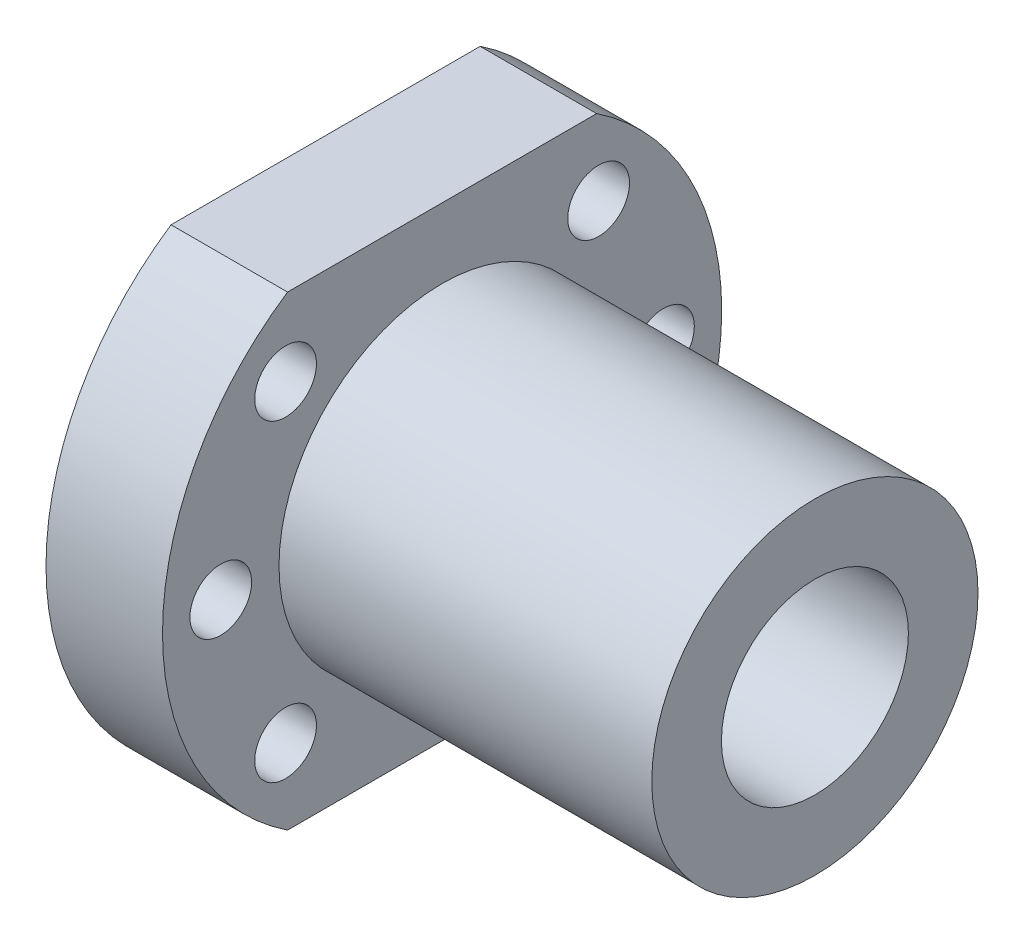
ISO-10303-21;
HEADER;
FILE_DESCRIPTION(('STEP AP214'),'2;1');
FILE_NAME('part.step','',(''),(''),'','','');
FILE_SCHEMA(('AUTOMOTIVE_DESIGN { 1 0 10303 214 1 1 1 1 }'));
ENDSEC;
DATA;
#1=APPLICATION_CONTEXT('core data for automotive mechanical design processes');
#2=APPLICATION_PROTOCOL_DEFINITION('international standard','automotive_design',2000,#1);
#3=PRODUCT_CONTEXT('',#1,'mechanical');
#4=PRODUCT('Part','Part','',(#3));
#5=PRODUCT_RELATED_PRODUCT_CATEGORY('part','',(#4));
#6=PRODUCT_DEFINITION_FORMATION('','',#4);
#7=PRODUCT_DEFINITION_CONTEXT('part definition',#1,'design');
#8=PRODUCT_DEFINITION('design','',#6,#7);
#9=PRODUCT_DEFINITION_SHAPE('','',#8);
#10=(LENGTH_UNIT() NAMED_UNIT(*) SI_UNIT(.MILLI.,.METRE.));
#11=(NAMED_UNIT(*) PLANE_ANGLE_UNIT() SI_UNIT($,.RADIAN.));
#12=(NAMED_UNIT(*) SI_UNIT($,.STERADIAN.) SOLID_ANGLE_UNIT());
#13=UNCERTAINTY_MEASURE_WITH_UNIT(LENGTH_MEASURE(1.E-05),#10,'distance_accuracy_value','');
#14=(GEOMETRIC_REPRESENTATION_CONTEXT(3) GLOBAL_UNCERTAINTY_ASSIGNED_CONTEXT((#13)) GLOBAL_UNIT_ASSIGNED_CONTEXT((#10,
#11,#12)) REPRESENTATION_CONTEXT('',''));
#15=CARTESIAN_POINT('',(0.,0.,0.));
#16=DIRECTION('',(0.,0.,1.));
#17=DIRECTION('',(1.,0.,0.));
#18=AXIS2_PLACEMENT_3D('',#15,#16,#17);
#19=CARTESIAN_POINT('',(10.,0.,0.));
#20=DIRECTION('',(-1.,0.,0.));
#21=DIRECTION('',(0.,0.,1.));
#22=AXIS2_PLACEMENT_3D('',#19,#20,#21);
#23=PLANE('',#22);
#24=CARTESIAN_POINT('',(10.,-13.4350288425444,-13.4350288425444));
#25=DIRECTION('',(1.,0.,0.));
#26=DIRECTION('',(0.,0.,-1.));
#27=AXIS2_PLACEMENT_3D('',#24,#25,#26);
#28=CIRCLE('',#27,2.65);
#29=CARTESIAN_POINT('',(10.,-13.4350288425444,-16.0850288425444));
#30=VERTEX_POINT('',#29);
#31=EDGE_CURVE('E186',#30,#30,#28,.T.);
#32=ORIENTED_EDGE('',*,*,#31,.F.);
#33=EDGE_LOOP('',(#32));
#34=FACE_BOUND('',#33,.T.);
#35=CARTESIAN_POINT('',(10.,13.4350288425444,13.4350288425444));
#36=DIRECTION('',(1.,0.,0.));
#37=DIRECTION('',(0.,0.,-1.));
#38=AXIS2_PLACEMENT_3D('',#35,#36,#37);
#39=CIRCLE('',#38,2.65);
#40=CARTESIAN_POINT('',(10.,13.4350288425444,10.7850288425444));
#41=VERTEX_POINT('',#40);
#42=EDGE_CURVE('E192',#41,#41,#39,.T.);
#43=ORIENTED_EDGE('',*,*,#42,.F.);
#44=EDGE_LOOP('',(#43));
#45=FACE_BOUND('',#44,.T.);
#46=CARTESIAN_POINT('',(10.,0.,19.));
#47=DIRECTION('',(1.,0.,0.));
#48=DIRECTION('',(0.,0.,-1.));
#49=AXIS2_PLACEMENT_3D('',#46,#47,#48);
#50=CIRCLE('',#49,2.65);
#51=CARTESIAN_POINT('',(10.,0.,16.35));
#52=VERTEX_POINT('',#51);
#53=EDGE_CURVE('E198',#52,#52,#50,.T.);
#54=ORIENTED_EDGE('',*,*,#53,.F.);
#55=EDGE_LOOP('',(#54));
#56=FACE_BOUND('',#55,.T.);
#57=CARTESIAN_POINT('',(10.,-13.4350288425444,13.4350288425444));
#58=DIRECTION('',(1.,0.,0.));
#59=DIRECTION('',(0.,0.,-1.));
#60=AXIS2_PLACEMENT_3D('',#57,#58,#59);
#61=CIRCLE('',#60,2.65);
#62=CARTESIAN_POINT('',(10.,-13.4350288425444,10.7850288425444));
#63=VERTEX_POINT('',#62);
#64=EDGE_CURVE('E204',#63,#63,#61,.T.);
#65=ORIENTED_EDGE('',*,*,#64,.F.);
#66=EDGE_LOOP('',(#65));
#67=FACE_BOUND('',#66,.T.);
#68=CARTESIAN_POINT('',(10.,0.,0.));
#69=DIRECTION('',(1.,0.,0.));
#70=DIRECTION('',(0.,0.,-1.));
#71=AXIS2_PLACEMENT_3D('',#68,#69,#70);
#72=CIRCLE('',#71,14.);
#73=CARTESIAN_POINT('',(10.,0.,-14.));
#74=VERTEX_POINT('',#73);
#75=EDGE_CURVE('E11',#74,#74,#72,.T.);
#76=ORIENTED_EDGE('',*,*,#75,.F.);
#77=EDGE_LOOP('',(#76));
#78=FACE_BOUND('',#77,.T.);
#79=CARTESIAN_POINT('',(10.,0.,0.));
#80=DIRECTION('',(-1.,0.,0.));
#81=DIRECTION('',(0.,0.,1.));
#82=AXIS2_PLACEMENT_3D('',#79,#80,#81);
#83=CIRCLE('',#82,24.);
#84=CARTESIAN_POINT('',(10.,20.,-13.2664991614216));
#85=VERTEX_POINT('',#84);
#86=CARTESIAN_POINT('',(10.,-20.,-13.2664991614216));
#87=VERTEX_POINT('',#86);
#88=EDGE_CURVE('E94',#85,#87,#83,.T.);
#89=ORIENTED_EDGE('',*,*,#88,.F.);
#90=DIRECTION('',(0.,0.,-1.));
#91=VECTOR('',#90,1.);
#92=CARTESIAN_POINT('',(10.,20.,13.2664991614216));
#93=LINE('',#92,#91);
#94=CARTESIAN_POINT('',(10.,20.,13.2664991614216));
#95=VERTEX_POINT('',#94);
#96=EDGE_CURVE('E91',#95,#85,#93,.T.);
#97=ORIENTED_EDGE('',*,*,#96,.F.);
#98=CARTESIAN_POINT('',(10.,0.,0.));
#99=DIRECTION('',(-1.,0.,0.));
#100=DIRECTION('',(0.,0.,1.));
#101=AXIS2_PLACEMENT_3D('',#98,#99,#100);
#102=CIRCLE('',#101,24.);
#103=CARTESIAN_POINT('',(10.,-20.,13.2664991614216));
#104=VERTEX_POINT('',#103);
#105=EDGE_CURVE('E84',#104,#95,#102,.T.);
#106=ORIENTED_EDGE('',*,*,#105,.F.);
#107=DIRECTION('',(0.,0.,1.));
#108=VECTOR('',#107,1.);
#109=CARTESIAN_POINT('',(10.,-20.,-13.2664991614216));
#110=LINE('',#109,#108);
#111=EDGE_CURVE('E90',#87,#104,#110,.T.);
#112=ORIENTED_EDGE('',*,*,#111,.F.);
#113=EDGE_LOOP('',(#89,#97,#106,#112));
#114=FACE_BOUND('',#113,.T.);
#115=CARTESIAN_POINT('',(10.,0.,-19.));
#116=DIRECTION('',(1.,0.,0.));
#117=DIRECTION('',(0.,0.,-1.));
#118=AXIS2_PLACEMENT_3D('',#115,#116,#117);
#119=CIRCLE('',#118,2.65);
#120=CARTESIAN_POINT('',(10.,0.,-21.65));
#121=VERTEX_POINT('',#120);
#122=EDGE_CURVE('E178',#121,#121,#119,.T.);
#123=ORIENTED_EDGE('',*,*,#122,.F.);
#124=EDGE_LOOP('',(#123));
#125=FACE_BOUND('',#124,.T.);
#126=CARTESIAN_POINT('',(10.,13.4350288425444,-13.4350288425444));
#127=DIRECTION('',(1.,0.,0.));
#128=DIRECTION('',(0.,0.,-1.));
#129=AXIS2_PLACEMENT_3D('',#126,#127,#128);
#130=CIRCLE('',#129,2.65);
#131=CARTESIAN_POINT('',(10.,13.4350288425444,-16.0850288425444));
#132=VERTEX_POINT('',#131);
#133=EDGE_CURVE('E175',#132,#132,#130,.T.);
#134=ORIENTED_EDGE('',*,*,#133,.F.);
#135=EDGE_LOOP('',(#134));
#136=FACE_BOUND('',#135,.T.);
#137=ADVANCED_FACE('F33',(#34,#45,#56,#67,#78,#114,#125,#136),#23,.F.);
#138=CARTESIAN_POINT('',(0.,0.,0.));
#139=DIRECTION('',(-1.,0.,0.));
#140=DIRECTION('',(0.,0.,1.));
#141=AXIS2_PLACEMENT_3D('',#138,#139,#140);
#142=PLANE('',#141);
#143=CARTESIAN_POINT('',(0.,13.4350288425444,-13.4350288425444));
#144=DIRECTION('',(1.,0.,0.));
#145=DIRECTION('',(0.,0.,-1.));
#146=AXIS2_PLACEMENT_3D('',#143,#144,#145);
#147=CIRCLE('',#146,2.65);
#148=CARTESIAN_POINT('',(0.,13.4350288425444,-16.0850288425444));
#149=VERTEX_POINT('',#148);
#150=EDGE_CURVE('E172',#149,#149,#147,.T.);
#151=ORIENTED_EDGE('',*,*,#150,.T.);
#152=EDGE_LOOP('',(#151));
#153=FACE_BOUND('',#152,.T.);
#154=CARTESIAN_POINT('',(0.,-13.4350288425444,-13.4350288425444));
#155=DIRECTION('',(1.,0.,0.));
#156=DIRECTION('',(0.,0.,-1.));
#157=AXIS2_PLACEMENT_3D('',#154,#155,#156);
#158=CIRCLE('',#157,2.65);
#159=CARTESIAN_POINT('',(0.,-13.4350288425444,-16.0850288425444));
#160=VERTEX_POINT('',#159);
#161=EDGE_CURVE('E189',#160,#160,#158,.T.);
#162=ORIENTED_EDGE('',*,*,#161,.T.);
#163=EDGE_LOOP('',(#162));
#164=FACE_BOUND('',#163,.T.);
#165=CARTESIAN_POINT('',(0.,13.4350288425444,13.4350288425444));
#166=DIRECTION('',(1.,0.,0.));
#167=DIRECTION('',(0.,0.,-1.));
#168=AXIS2_PLACEMENT_3D('',#165,#166,#167);
#169=CIRCLE('',#168,2.65);
#170=CARTESIAN_POINT('',(0.,13.4350288425444,10.7850288425444));
#171=VERTEX_POINT('',#170);
#172=EDGE_CURVE('E195',#171,#171,#169,.T.);
#173=ORIENTED_EDGE('',*,*,#172,.T.);
#174=EDGE_LOOP('',(#173));
#175=FACE_BOUND('',#174,.T.);
#176=CARTESIAN_POINT('',(0.,0.,19.));
#177=DIRECTION('',(1.,0.,0.));
#178=DIRECTION('',(0.,0.,-1.));
#179=AXIS2_PLACEMENT_3D('',#176,#177,#178);
#180=CIRCLE('',#179,2.65);
#181=CARTESIAN_POINT('',(0.,0.,16.35));
#182=VERTEX_POINT('',#181);
#183=EDGE_CURVE('E201',#182,#182,#180,.T.);
#184=ORIENTED_EDGE('',*,*,#183,.T.);
#185=EDGE_LOOP('',(#184));
#186=FACE_BOUND('',#185,.T.);
#187=CARTESIAN_POINT('',(0.,-13.4350288425444,13.4350288425444));
#188=DIRECTION('',(1.,0.,0.));
#189=DIRECTION('',(0.,0.,-1.));
#190=AXIS2_PLACEMENT_3D('',#187,#188,#189);
#191=CIRCLE('',#190,2.65);
#192=CARTESIAN_POINT('',(0.,-13.4350288425444,10.7850288425444));
#193=VERTEX_POINT('',#192);
#194=EDGE_CURVE('E207',#193,#193,#191,.T.);
#195=ORIENTED_EDGE('',*,*,#194,.T.);
#196=EDGE_LOOP('',(#195));
#197=FACE_BOUND('',#196,.T.);
#198=CARTESIAN_POINT('',(0.,0.,0.));
#199=DIRECTION('',(1.,0.,0.));
#200=DIRECTION('',(0.,0.,-1.));
#201=AXIS2_PLACEMENT_3D('',#198,#199,#200);
#202=CIRCLE('',#201,8.02500000000001);
#203=CARTESIAN_POINT('',(0.,0.,-8.02500000000001));
#204=VERTEX_POINT('',#203);
#205=EDGE_CURVE('E213',#204,#204,#202,.T.);
#206=ORIENTED_EDGE('',*,*,#205,.T.);
#207=EDGE_LOOP('',(#206));
#208=FACE_BOUND('',#207,.T.);
#209=CARTESIAN_POINT('',(0.,0.,0.));
#210=DIRECTION('',(-1.,0.,0.));
#211=DIRECTION('',(0.,0.,1.));
#212=AXIS2_PLACEMENT_3D('',#209,#210,#211);
#213=CIRCLE('',#212,24.);
#214=CARTESIAN_POINT('',(0.,20.,-13.2664991614216));
#215=VERTEX_POINT('',#214);
#216=CARTESIAN_POINT('',(0.,-20.,-13.2664991614216));
#217=VERTEX_POINT('',#216);
#218=EDGE_CURVE('E100',#215,#217,#213,.T.);
#219=ORIENTED_EDGE('',*,*,#218,.T.);
#220=DIRECTION('',(0.,0.,1.));
#221=VECTOR('',#220,1.);
#222=CARTESIAN_POINT('',(0.,-20.,-13.2664991614216));
#223=LINE('',#222,#221);
#224=CARTESIAN_POINT('',(0.,-20.,13.2664991614216));
#225=VERTEX_POINT('',#224);
#226=EDGE_CURVE('E103',#217,#225,#223,.T.);
#227=ORIENTED_EDGE('',*,*,#226,.T.);
#228=CARTESIAN_POINT('',(0.,0.,0.));
#229=DIRECTION('',(-1.,0.,0.));
#230=DIRECTION('',(0.,0.,1.));
#231=AXIS2_PLACEMENT_3D('',#228,#229,#230);
#232=CIRCLE('',#231,24.);
#233=CARTESIAN_POINT('',(0.,20.,13.2664991614216));
#234=VERTEX_POINT('',#233);
#235=EDGE_CURVE('E86',#225,#234,#232,.T.);
#236=ORIENTED_EDGE('',*,*,#235,.T.);
#237=DIRECTION('',(0.,0.,-1.));
#238=VECTOR('',#237,1.);
#239=CARTESIAN_POINT('',(0.,20.,13.2664991614216));
#240=LINE('',#239,#238);
#241=EDGE_CURVE('E96',#234,#215,#240,.T.);
#242=ORIENTED_EDGE('',*,*,#241,.T.);
#243=EDGE_LOOP('',(#219,#227,#236,#242));
#244=FACE_BOUND('',#243,.T.);
#245=CARTESIAN_POINT('',(0.,0.,-19.));
#246=DIRECTION('',(1.,0.,0.));
#247=DIRECTION('',(0.,0.,-1.));
#248=AXIS2_PLACEMENT_3D('',#245,#246,#247);
#249=CIRCLE('',#248,2.65);
#250=CARTESIAN_POINT('',(0.,0.,-21.65));
#251=VERTEX_POINT('',#250);
#252=EDGE_CURVE('E183',#251,#251,#249,.T.);
#253=ORIENTED_EDGE('',*,*,#252,.T.);
#254=EDGE_LOOP('',(#253));
#255=FACE_BOUND('',#254,.T.);
#256=ADVANCED_FACE('F111',(#153,#164,#175,#186,#197,#208,#244,#255),#142,.T.);
#257=CARTESIAN_POINT('',(10.,0.,0.));
#258=DIRECTION('',(-1.,0.,0.));
#259=DIRECTION('',(0.,0.,1.));
#260=AXIS2_PLACEMENT_3D('',#257,#258,#259);
#261=CYLINDRICAL_SURFACE('',#260,24.);
#262=ORIENTED_EDGE('',*,*,#218,.F.);
#263=DIRECTION('',(-1.,0.,0.));
#264=VECTOR('',#263,1.);
#265=CARTESIAN_POINT('',(10.,20.,-13.2664991614216));
#266=LINE('',#265,#264);
#267=EDGE_CURVE('E43',#85,#215,#266,.T.);
#268=ORIENTED_EDGE('',*,*,#267,.F.);
#269=ORIENTED_EDGE('',*,*,#88,.T.);
#270=DIRECTION('',(-1.,0.,0.));
#271=VECTOR('',#270,1.);
#272=CARTESIAN_POINT('',(10.,-20.,-13.2664991614216));
#273=LINE('',#272,#271);
#274=EDGE_CURVE('E37',#87,#217,#273,.T.);
#275=ORIENTED_EDGE('',*,*,#274,.T.);
#276=EDGE_LOOP('',(#262,#268,#269,#275));
#277=FACE_BOUND('',#276,.T.);
#278=ADVANCED_FACE('F35',(#277),#261,.T.);
#279=CARTESIAN_POINT('',(10.,20.,13.2664991614216));
#280=DIRECTION('',(0.,1.,0.));
#281=DIRECTION('',(0.,0.,1.));
#282=AXIS2_PLACEMENT_3D('',#279,#280,#281);
#283=PLANE('',#282);
#284=ORIENTED_EDGE('',*,*,#241,.F.);
#285=DIRECTION('',(-1.,0.,0.));
#286=VECTOR('',#285,1.);
#287=CARTESIAN_POINT('',(10.,20.,13.2664991614216));
#288=LINE('',#287,#286);
#289=EDGE_CURVE('E68',#95,#234,#288,.T.);
#290=ORIENTED_EDGE('',*,*,#289,.F.);
#291=ORIENTED_EDGE('',*,*,#96,.T.);
#292=ORIENTED_EDGE('',*,*,#267,.T.);
#293=EDGE_LOOP('',(#284,#290,#291,#292));
#294=FACE_BOUND('',#293,.T.);
#295=ADVANCED_FACE('F113',(#294),#283,.T.);
#296=CARTESIAN_POINT('',(10.,0.,0.));
#297=DIRECTION('',(-1.,0.,0.));
#298=DIRECTION('',(0.,0.,1.));
#299=AXIS2_PLACEMENT_3D('',#296,#297,#298);
#300=CYLINDRICAL_SURFACE('',#299,24.);
#301=ORIENTED_EDGE('',*,*,#235,.F.);
#302=DIRECTION('',(-1.,0.,0.));
#303=VECTOR('',#302,1.);
#304=CARTESIAN_POINT('',(10.,-20.,13.2664991614216));
#305=LINE('',#304,#303);
#306=EDGE_CURVE('E81',#104,#225,#305,.T.);
#307=ORIENTED_EDGE('',*,*,#306,.F.);
#308=ORIENTED_EDGE('',*,*,#105,.T.);
#309=ORIENTED_EDGE('',*,*,#289,.T.);
#310=EDGE_LOOP('',(#301,#307,#308,#309));
#311=FACE_BOUND('',#310,.T.);
#312=ADVANCED_FACE('F83',(#311),#300,.T.);
#313=CARTESIAN_POINT('',(10.,-20.,-13.2664991614216));
#314=DIRECTION('',(0.,-1.,0.));
#315=DIRECTION('',(0.,0.,-1.));
#316=AXIS2_PLACEMENT_3D('',#313,#314,#315);
#317=PLANE('',#316);
#318=ORIENTED_EDGE('',*,*,#226,.F.);
#319=ORIENTED_EDGE('',*,*,#274,.F.);
#320=ORIENTED_EDGE('',*,*,#111,.T.);
#321=ORIENTED_EDGE('',*,*,#306,.T.);
#322=EDGE_LOOP('',(#318,#319,#320,#321));
#323=FACE_BOUND('',#322,.T.);
#324=ADVANCED_FACE('F93',(#323),#317,.T.);
#325=CARTESIAN_POINT('',(10.,0.,0.));
#326=DIRECTION('',(1.,0.,0.));
#327=DIRECTION('',(0.,0.,-1.));
#328=AXIS2_PLACEMENT_3D('',#325,#326,#327);
#329=CYLINDRICAL_SURFACE('',#328,14.);
#330=ORIENTED_EDGE('',*,*,#75,.T.);
#331=EDGE_LOOP('',(#330));
#332=FACE_BOUND('',#331,.T.);
#333=CARTESIAN_POINT('',(42.,0.,0.));
#334=DIRECTION('',(1.,0.,0.));
#335=DIRECTION('',(0.,0.,-1.));
#336=AXIS2_PLACEMENT_3D('',#333,#334,#335);
#337=CIRCLE('',#336,14.);
#338=CARTESIAN_POINT('',(42.,0.,-14.));
#339=VERTEX_POINT('',#338);
#340=EDGE_CURVE('E104',#339,#339,#337,.T.);
#341=ORIENTED_EDGE('',*,*,#340,.F.);
#342=EDGE_LOOP('',(#341));
#343=FACE_BOUND('',#342,.T.);
#344=ADVANCED_FACE('F132',(#332,#343),#329,.T.);
#345=CARTESIAN_POINT('',(42.,0.,0.));
#346=DIRECTION('',(1.,0.,0.));
#347=DIRECTION('',(0.,0.,-1.));
#348=AXIS2_PLACEMENT_3D('',#345,#346,#347);
#349=PLANE('',#348);
#350=CARTESIAN_POINT('',(42.,0.,0.));
#351=DIRECTION('',(1.,0.,0.));
#352=DIRECTION('',(0.,0.,-1.));
#353=AXIS2_PLACEMENT_3D('',#350,#351,#352);
#354=CIRCLE('',#353,8.02500000000001);
#355=CARTESIAN_POINT('',(42.,0.,-8.02500000000001));
#356=VERTEX_POINT('',#355);
#357=EDGE_CURVE('E210',#356,#356,#354,.T.);
#358=ORIENTED_EDGE('',*,*,#357,.F.);
#359=EDGE_LOOP('',(#358));
#360=FACE_BOUND('',#359,.T.);
#361=ORIENTED_EDGE('',*,*,#340,.T.);
#362=EDGE_LOOP('',(#361));
#363=FACE_BOUND('',#362,.T.);
#364=ADVANCED_FACE('F135',(#360,#363),#349,.T.);
#365=CARTESIAN_POINT('',(42.,0.,0.));
#366=DIRECTION('',(1.,0.,0.));
#367=DIRECTION('',(0.,0.,-1.));
#368=AXIS2_PLACEMENT_3D('',#365,#366,#367);
#369=CYLINDRICAL_SURFACE('',#368,8.02500000000001);
#370=ORIENTED_EDGE('',*,*,#205,.F.);
#371=EDGE_LOOP('',(#370));
#372=FACE_BOUND('',#371,.T.);
#373=ORIENTED_EDGE('',*,*,#357,.T.);
#374=EDGE_LOOP('',(#373));
#375=FACE_BOUND('',#374,.T.);
#376=ADVANCED_FACE('F139',(#372,#375),#369,.F.);
#377=CARTESIAN_POINT('',(10.,-13.4350288425444,13.4350288425444));
#378=DIRECTION('',(1.,0.,0.));
#379=DIRECTION('',(0.,0.,-1.));
#380=AXIS2_PLACEMENT_3D('',#377,#378,#379);
#381=CYLINDRICAL_SURFACE('',#380,2.65);
#382=ORIENTED_EDGE('',*,*,#194,.F.);
#383=EDGE_LOOP('',(#382));
#384=FACE_BOUND('',#383,.T.);
#385=ORIENTED_EDGE('',*,*,#64,.T.);
#386=EDGE_LOOP('',(#385));
#387=FACE_BOUND('',#386,.T.);
#388=ADVANCED_FACE('F143',(#384,#387),#381,.F.);
#389=CARTESIAN_POINT('',(10.,0.,19.));
#390=DIRECTION('',(1.,0.,0.));
#391=DIRECTION('',(0.,0.,-1.));
#392=AXIS2_PLACEMENT_3D('',#389,#390,#391);
#393=CYLINDRICAL_SURFACE('',#392,2.65);
#394=ORIENTED_EDGE('',*,*,#183,.F.);
#395=EDGE_LOOP('',(#394));
#396=FACE_BOUND('',#395,.T.);
#397=ORIENTED_EDGE('',*,*,#53,.T.);
#398=EDGE_LOOP('',(#397));
#399=FACE_BOUND('',#398,.T.);
#400=ADVANCED_FACE('F147',(#396,#399),#393,.F.);
#401=CARTESIAN_POINT('',(10.,13.4350288425444,13.4350288425444));
#402=DIRECTION('',(1.,0.,0.));
#403=DIRECTION('',(0.,0.,-1.));
#404=AXIS2_PLACEMENT_3D('',#401,#402,#403);
#405=CYLINDRICAL_SURFACE('',#404,2.65);
#406=ORIENTED_EDGE('',*,*,#172,.F.);
#407=EDGE_LOOP('',(#406));
#408=FACE_BOUND('',#407,.T.);
#409=ORIENTED_EDGE('',*,*,#42,.T.);
#410=EDGE_LOOP('',(#409));
#411=FACE_BOUND('',#410,.T.);
#412=ADVANCED_FACE('F151',(#408,#411),#405,.F.);
#413=CARTESIAN_POINT('',(10.,-13.4350288425444,-13.4350288425444));
#414=DIRECTION('',(1.,0.,0.));
#415=DIRECTION('',(0.,0.,-1.));
#416=AXIS2_PLACEMENT_3D('',#413,#414,#415);
#417=CYLINDRICAL_SURFACE('',#416,2.65);
#418=ORIENTED_EDGE('',*,*,#161,.F.);
#419=EDGE_LOOP('',(#418));
#420=FACE_BOUND('',#419,.T.);
#421=ORIENTED_EDGE('',*,*,#31,.T.);
#422=EDGE_LOOP('',(#421));
#423=FACE_BOUND('',#422,.T.);
#424=ADVANCED_FACE('F155',(#420,#423),#417,.F.);
#425=CARTESIAN_POINT('',(10.,0.,-19.));
#426=DIRECTION('',(1.,0.,0.));
#427=DIRECTION('',(0.,0.,-1.));
#428=AXIS2_PLACEMENT_3D('',#425,#426,#427);
#429=CYLINDRICAL_SURFACE('',#428,2.65);
#430=ORIENTED_EDGE('',*,*,#252,.F.);
#431=EDGE_LOOP('',(#430));
#432=FACE_BOUND('',#431,.T.);
#433=ORIENTED_EDGE('',*,*,#122,.T.);
#434=EDGE_LOOP('',(#433));
#435=FACE_BOUND('',#434,.T.);
#436=ADVANCED_FACE('F159',(#432,#435),#429,.F.);
#437=CARTESIAN_POINT('',(10.,13.4350288425444,-13.4350288425444));
#438=DIRECTION('',(1.,0.,0.));
#439=DIRECTION('',(0.,0.,-1.));
#440=AXIS2_PLACEMENT_3D('',#437,#438,#439);
#441=CYLINDRICAL_SURFACE('',#440,2.65);
#442=ORIENTED_EDGE('',*,*,#150,.F.);
#443=EDGE_LOOP('',(#442));
#444=FACE_BOUND('',#443,.T.);
#445=ORIENTED_EDGE('',*,*,#133,.T.);
#446=EDGE_LOOP('',(#445));
#447=FACE_BOUND('',#446,.T.);
#448=ADVANCED_FACE('F163',(#444,#447),#441,.F.);
#449=CLOSED_SHELL('',(#137,#256,#278,#295,#312,#324,#344,#364,#376,#388,#400,#412,#424,#436,#448));
#450=MANIFOLD_SOLID_BREP('B2',#449);
#451=ADVANCED_BREP_SHAPE_REPRESENTATION('',(#18,#450),#14);
#452=SHAPE_DEFINITION_REPRESENTATION(#9,#451);
ENDSEC;
END-ISO-10303-21;
